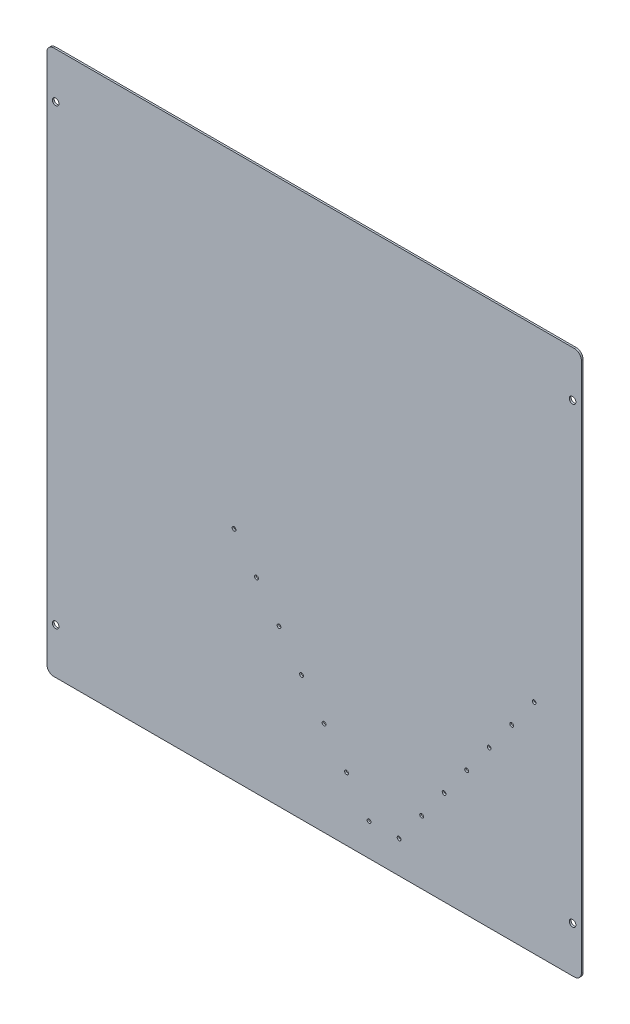
ISO-10303-21;
HEADER;
FILE_DESCRIPTION(('STEP AP214'),'2;1');
FILE_NAME('part.step','',(''),(''),'','','');
FILE_SCHEMA(('AUTOMOTIVE_DESIGN { 1 0 10303 214 1 1 1 1 }'));
ENDSEC;
DATA;
#1=APPLICATION_CONTEXT('core data for automotive mechanical design processes');
#2=APPLICATION_PROTOCOL_DEFINITION('international standard','automotive_design',2000,#1);
#3=PRODUCT_CONTEXT('',#1,'mechanical');
#4=PRODUCT('Part','Part','',(#3));
#5=PRODUCT_RELATED_PRODUCT_CATEGORY('part','',(#4));
#6=PRODUCT_DEFINITION_FORMATION('','',#4);
#7=PRODUCT_DEFINITION_CONTEXT('part definition',#1,'design');
#8=PRODUCT_DEFINITION('design','',#6,#7);
#9=PRODUCT_DEFINITION_SHAPE('','',#8);
#10=(LENGTH_UNIT() NAMED_UNIT(*) SI_UNIT(.MILLI.,.METRE.));
#11=(NAMED_UNIT(*) PLANE_ANGLE_UNIT() SI_UNIT($,.RADIAN.));
#12=(NAMED_UNIT(*) SI_UNIT($,.STERADIAN.) SOLID_ANGLE_UNIT());
#13=UNCERTAINTY_MEASURE_WITH_UNIT(LENGTH_MEASURE(1.E-05),#10,'distance_accuracy_value','');
#14=(GEOMETRIC_REPRESENTATION_CONTEXT(3) GLOBAL_UNCERTAINTY_ASSIGNED_CONTEXT((#13)) GLOBAL_UNIT_ASSIGNED_CONTEXT((#10,
#11,#12)) REPRESENTATION_CONTEXT('',''));
#15=CARTESIAN_POINT('',(0.,0.,0.));
#16=DIRECTION('',(0.,0.,1.));
#17=DIRECTION('',(1.,0.,0.));
#18=AXIS2_PLACEMENT_3D('',#15,#16,#17);
#19=CARTESIAN_POINT('',(6.35,6.35,-1.5875));
#20=DIRECTION('',(0.,0.,1.));
#21=DIRECTION('',(1.,0.,0.));
#22=AXIS2_PLACEMENT_3D('',#19,#20,#21);
#23=CYLINDRICAL_SURFACE('',#22,6.35);
#24=CARTESIAN_POINT('',(6.35,6.35,0.));
#25=DIRECTION('',(0.,0.,1.));
#26=DIRECTION('',(1.,0.,0.));
#27=AXIS2_PLACEMENT_3D('',#24,#25,#26);
#28=CIRCLE('',#27,6.35);
#29=CARTESIAN_POINT('',(0.,6.35000000000004,0.));
#30=VERTEX_POINT('',#29);
#31=CARTESIAN_POINT('',(6.35000000000004,0.,0.));
#32=VERTEX_POINT('',#31);
#33=EDGE_CURVE('E133',#30,#32,#28,.T.);
#34=ORIENTED_EDGE('',*,*,#33,.F.);
#35=DIRECTION('',(0.,0.,1.));
#36=VECTOR('',#35,1.);
#37=CARTESIAN_POINT('',(0.,6.35000000000004,-1.5875));
#38=LINE('',#37,#36);
#39=CARTESIAN_POINT('',(0.,6.35000000000004,-1.5875));
#40=VERTEX_POINT('',#39);
#41=EDGE_CURVE('E11',#40,#30,#38,.T.);
#42=ORIENTED_EDGE('',*,*,#41,.F.);
#43=CARTESIAN_POINT('',(6.35,6.35,-1.5875));
#44=DIRECTION('',(0.,0.,1.));
#45=DIRECTION('',(1.,0.,0.));
#46=AXIS2_PLACEMENT_3D('',#43,#44,#45);
#47=CIRCLE('',#46,6.35);
#48=CARTESIAN_POINT('',(6.35000000000004,0.,-1.5875));
#49=VERTEX_POINT('',#48);
#50=EDGE_CURVE('E154',#40,#49,#47,.T.);
#51=ORIENTED_EDGE('',*,*,#50,.T.);
#52=DIRECTION('',(0.,0.,1.));
#53=VECTOR('',#52,1.);
#54=CARTESIAN_POINT('',(6.35000000000004,0.,-1.5875));
#55=LINE('',#54,#53);
#56=EDGE_CURVE('E91',#49,#32,#55,.T.);
#57=ORIENTED_EDGE('',*,*,#56,.T.);
#58=EDGE_LOOP('',(#34,#42,#51,#57));
#59=FACE_BOUND('',#58,.T.);
#60=ADVANCED_FACE('F35',(#59),#23,.T.);
#61=CARTESIAN_POINT('',(0.,6.35000000000004,-1.5875));
#62=DIRECTION('',(-1.,0.,0.));
#63=DIRECTION('',(0.,-1.,0.));
#64=AXIS2_PLACEMENT_3D('',#61,#62,#63);
#65=PLANE('',#64);
#66=DIRECTION('',(0.,-1.,0.));
#67=VECTOR('',#66,1.);
#68=CARTESIAN_POINT('',(0.,6.35000000000004,0.));
#69=LINE('',#68,#67);
#70=CARTESIAN_POINT('',(-1.09587905789873E-13,485.14,0.));
#71=VERTEX_POINT('',#70);
#72=EDGE_CURVE('E152',#71,#30,#69,.T.);
#73=ORIENTED_EDGE('',*,*,#72,.F.);
#74=DIRECTION('',(0.,0.,1.));
#75=VECTOR('',#74,1.);
#76=CARTESIAN_POINT('',(-1.09587905789873E-13,485.14,-1.5875));
#77=LINE('',#76,#75);
#78=CARTESIAN_POINT('',(-1.09587905789873E-13,485.14,-1.5875));
#79=VERTEX_POINT('',#78);
#80=EDGE_CURVE('E44',#79,#71,#77,.T.);
#81=ORIENTED_EDGE('',*,*,#80,.F.);
#82=DIRECTION('',(0.,-1.,0.));
#83=VECTOR('',#82,1.);
#84=CARTESIAN_POINT('',(0.,6.35000000000004,-1.5875));
#85=LINE('',#84,#83);
#86=EDGE_CURVE('E123',#79,#40,#85,.T.);
#87=ORIENTED_EDGE('',*,*,#86,.T.);
#88=ORIENTED_EDGE('',*,*,#41,.T.);
#89=EDGE_LOOP('',(#73,#81,#87,#88));
#90=FACE_BOUND('',#89,.T.);
#91=ADVANCED_FACE('F226',(#90),#65,.T.);
#92=CARTESIAN_POINT('',(6.34999999999989,485.14,-1.5875));
#93=DIRECTION('',(0.,0.,1.));
#94=DIRECTION('',(1.,0.,0.));
#95=AXIS2_PLACEMENT_3D('',#92,#93,#94);
#96=CYLINDRICAL_SURFACE('',#95,6.35000000000001);
#97=CARTESIAN_POINT('',(6.34999999999989,485.14,0.));
#98=DIRECTION('',(0.,0.,1.));
#99=DIRECTION('',(-1.,0.,0.));
#100=AXIS2_PLACEMENT_3D('',#97,#98,#99);
#101=CIRCLE('',#100,6.35000000000001);
#102=CARTESIAN_POINT('',(6.34999999999993,491.49,0.));
#103=VERTEX_POINT('',#102);
#104=EDGE_CURVE('E110',#103,#71,#101,.T.);
#105=ORIENTED_EDGE('',*,*,#104,.F.);
#106=DIRECTION('',(0.,0.,1.));
#107=VECTOR('',#106,1.);
#108=CARTESIAN_POINT('',(6.34999999999993,491.49,-1.5875));
#109=LINE('',#108,#107);
#110=CARTESIAN_POINT('',(6.34999999999993,491.49,-1.5875));
#111=VERTEX_POINT('',#110);
#112=EDGE_CURVE('E105',#111,#103,#109,.T.);
#113=ORIENTED_EDGE('',*,*,#112,.F.);
#114=CARTESIAN_POINT('',(6.34999999999989,485.14,-1.5875));
#115=DIRECTION('',(0.,0.,1.));
#116=DIRECTION('',(-1.,0.,0.));
#117=AXIS2_PLACEMENT_3D('',#114,#115,#116);
#118=CIRCLE('',#117,6.35000000000001);
#119=EDGE_CURVE('E108',#111,#79,#118,.T.);
#120=ORIENTED_EDGE('',*,*,#119,.T.);
#121=ORIENTED_EDGE('',*,*,#80,.T.);
#122=EDGE_LOOP('',(#105,#113,#120,#121));
#123=FACE_BOUND('',#122,.T.);
#124=ADVANCED_FACE('F107',(#123),#96,.T.);
#125=CARTESIAN_POINT('',(6.34999999999993,491.49,-1.5875));
#126=DIRECTION('',(0.,1.,0.));
#127=DIRECTION('',(0.,0.,1.));
#128=AXIS2_PLACEMENT_3D('',#125,#126,#127);
#129=PLANE('',#128);
#130=DIRECTION('',(-1.,0.,0.));
#131=VECTOR('',#130,1.);
#132=CARTESIAN_POINT('',(6.34999999999993,491.49,0.));
#133=LINE('',#132,#131);
#134=CARTESIAN_POINT('',(476.25,491.49,0.));
#135=VERTEX_POINT('',#134);
#136=EDGE_CURVE('E149',#135,#103,#133,.T.);
#137=ORIENTED_EDGE('',*,*,#136,.F.);
#138=DIRECTION('',(0.,0.,1.));
#139=VECTOR('',#138,1.);
#140=CARTESIAN_POINT('',(476.25,491.49,-1.5875));
#141=LINE('',#140,#139);
#142=CARTESIAN_POINT('',(476.25,491.49,-1.5875));
#143=VERTEX_POINT('',#142);
#144=EDGE_CURVE('E115',#143,#135,#141,.T.);
#145=ORIENTED_EDGE('',*,*,#144,.F.);
#146=DIRECTION('',(-1.,0.,0.));
#147=VECTOR('',#146,1.);
#148=CARTESIAN_POINT('',(6.34999999999993,491.49,-1.5875));
#149=LINE('',#148,#147);
#150=EDGE_CURVE('E121',#143,#111,#149,.T.);
#151=ORIENTED_EDGE('',*,*,#150,.T.);
#152=ORIENTED_EDGE('',*,*,#112,.T.);
#153=EDGE_LOOP('',(#137,#145,#151,#152));
#154=FACE_BOUND('',#153,.T.);
#155=ADVANCED_FACE('F125',(#154),#129,.T.);
#156=CARTESIAN_POINT('',(476.25,485.14,-1.5875));
#157=DIRECTION('',(0.,0.,1.));
#158=DIRECTION('',(1.,0.,0.));
#159=AXIS2_PLACEMENT_3D('',#156,#157,#158);
#160=CYLINDRICAL_SURFACE('',#159,6.35000000000002);
#161=CARTESIAN_POINT('',(476.25,485.14,0.));
#162=DIRECTION('',(0.,0.,1.));
#163=DIRECTION('',(1.,0.,0.));
#164=AXIS2_PLACEMENT_3D('',#161,#162,#163);
#165=CIRCLE('',#164,6.35000000000002);
#166=CARTESIAN_POINT('',(482.6,485.14,0.));
#167=VERTEX_POINT('',#166);
#168=EDGE_CURVE('E146',#167,#135,#165,.T.);
#169=ORIENTED_EDGE('',*,*,#168,.F.);
#170=DIRECTION('',(0.,0.,1.));
#171=VECTOR('',#170,1.);
#172=CARTESIAN_POINT('',(482.6,485.14,-1.5875));
#173=LINE('',#172,#171);
#174=CARTESIAN_POINT('',(482.6,485.14,-1.5875));
#175=VERTEX_POINT('',#174);
#176=EDGE_CURVE('E158',#175,#167,#173,.T.);
#177=ORIENTED_EDGE('',*,*,#176,.F.);
#178=CARTESIAN_POINT('',(476.25,485.14,-1.5875));
#179=DIRECTION('',(0.,0.,1.));
#180=DIRECTION('',(1.,0.,0.));
#181=AXIS2_PLACEMENT_3D('',#178,#179,#180);
#182=CIRCLE('',#181,6.35000000000002);
#183=EDGE_CURVE('E126',#175,#143,#182,.T.);
#184=ORIENTED_EDGE('',*,*,#183,.T.);
#185=ORIENTED_EDGE('',*,*,#144,.T.);
#186=EDGE_LOOP('',(#169,#177,#184,#185));
#187=FACE_BOUND('',#186,.T.);
#188=ADVANCED_FACE('F239',(#187),#160,.T.);
#189=CARTESIAN_POINT('',(482.6,6.35000000000004,-1.5875));
#190=DIRECTION('',(1.,0.,0.));
#191=DIRECTION('',(0.,1.,0.));
#192=AXIS2_PLACEMENT_3D('',#189,#190,#191);
#193=PLANE('',#192);
#194=DIRECTION('',(0.,1.,0.));
#195=VECTOR('',#194,1.);
#196=CARTESIAN_POINT('',(482.6,6.35000000000004,0.));
#197=LINE('',#196,#195);
#198=CARTESIAN_POINT('',(482.6,6.35000000000004,0.));
#199=VERTEX_POINT('',#198);
#200=EDGE_CURVE('E143',#199,#167,#197,.T.);
#201=ORIENTED_EDGE('',*,*,#200,.F.);
#202=DIRECTION('',(0.,0.,1.));
#203=VECTOR('',#202,1.);
#204=CARTESIAN_POINT('',(482.6,6.35000000000004,-1.5875));
#205=LINE('',#204,#203);
#206=CARTESIAN_POINT('',(482.6,6.35000000000004,-1.5875));
#207=VERTEX_POINT('',#206);
#208=EDGE_CURVE('E160',#207,#199,#205,.T.);
#209=ORIENTED_EDGE('',*,*,#208,.F.);
#210=DIRECTION('',(0.,1.,0.));
#211=VECTOR('',#210,1.);
#212=CARTESIAN_POINT('',(482.6,6.35000000000004,-1.5875));
#213=LINE('',#212,#211);
#214=EDGE_CURVE('E128',#207,#175,#213,.T.);
#215=ORIENTED_EDGE('',*,*,#214,.T.);
#216=ORIENTED_EDGE('',*,*,#176,.T.);
#217=EDGE_LOOP('',(#201,#209,#215,#216));
#218=FACE_BOUND('',#217,.T.);
#219=ADVANCED_FACE('F217',(#218),#193,.T.);
#220=CARTESIAN_POINT('',(476.25,6.35,-1.5875));
#221=DIRECTION('',(0.,0.,1.));
#222=DIRECTION('',(1.,0.,0.));
#223=AXIS2_PLACEMENT_3D('',#220,#221,#222);
#224=CYLINDRICAL_SURFACE('',#223,6.35000000000001);
#225=CARTESIAN_POINT('',(476.25,6.35,0.));
#226=DIRECTION('',(0.,0.,1.));
#227=DIRECTION('',(1.,0.,0.));
#228=AXIS2_PLACEMENT_3D('',#225,#226,#227);
#229=CIRCLE('',#228,6.35000000000001);
#230=CARTESIAN_POINT('',(476.25,0.,0.));
#231=VERTEX_POINT('',#230);
#232=EDGE_CURVE('E140',#231,#199,#229,.T.);
#233=ORIENTED_EDGE('',*,*,#232,.F.);
#234=DIRECTION('',(0.,0.,1.));
#235=VECTOR('',#234,1.);
#236=CARTESIAN_POINT('',(476.25,0.,-1.5875));
#237=LINE('',#236,#235);
#238=CARTESIAN_POINT('',(476.25,0.,-1.5875));
#239=VERTEX_POINT('',#238);
#240=EDGE_CURVE('E162',#239,#231,#237,.T.);
#241=ORIENTED_EDGE('',*,*,#240,.F.);
#242=CARTESIAN_POINT('',(476.25,6.35,-1.5875));
#243=DIRECTION('',(0.,0.,1.));
#244=DIRECTION('',(1.,0.,0.));
#245=AXIS2_PLACEMENT_3D('',#242,#243,#244);
#246=CIRCLE('',#245,6.35000000000001);
#247=EDGE_CURVE('E211',#239,#207,#246,.T.);
#248=ORIENTED_EDGE('',*,*,#247,.T.);
#249=ORIENTED_EDGE('',*,*,#208,.T.);
#250=EDGE_LOOP('',(#233,#241,#248,#249));
#251=FACE_BOUND('',#250,.T.);
#252=ADVANCED_FACE('F222',(#251),#224,.T.);
#253=CARTESIAN_POINT('',(6.35000000000004,0.,-1.5875));
#254=DIRECTION('',(0.,-1.,0.));
#255=DIRECTION('',(0.,0.,-1.));
#256=AXIS2_PLACEMENT_3D('',#253,#254,#255);
#257=PLANE('',#256);
#258=DIRECTION('',(1.,0.,0.));
#259=VECTOR('',#258,1.);
#260=CARTESIAN_POINT('',(6.35000000000004,0.,0.));
#261=LINE('',#260,#259);
#262=EDGE_CURVE('E136',#32,#231,#261,.T.);
#263=ORIENTED_EDGE('',*,*,#262,.F.);
#264=ORIENTED_EDGE('',*,*,#56,.F.);
#265=DIRECTION('',(1.,0.,0.));
#266=VECTOR('',#265,1.);
#267=CARTESIAN_POINT('',(6.35000000000004,0.,-1.5875));
#268=LINE('',#267,#266);
#269=EDGE_CURVE('E209',#49,#239,#268,.T.);
#270=ORIENTED_EDGE('',*,*,#269,.T.);
#271=ORIENTED_EDGE('',*,*,#240,.T.);
#272=EDGE_LOOP('',(#263,#264,#270,#271));
#273=FACE_BOUND('',#272,.T.);
#274=ADVANCED_FACE('F223',(#273),#257,.T.);
#275=CARTESIAN_POINT('',(6.35,6.35,-1.5875));
#276=DIRECTION('',(0.,0.,1.));
#277=DIRECTION('',(1.,0.,0.));
#278=AXIS2_PLACEMENT_3D('',#275,#276,#277);
#279=PLANE('',#278);
#280=CARTESIAN_POINT('',(168.98874,196.850000000002,-1.5875));
#281=DIRECTION('',(0.,0.,1.));
#282=DIRECTION('',(1.,0.,0.));
#283=AXIS2_PLACEMENT_3D('',#280,#281,#282);
#284=CIRCLE('',#283,1.72719999999998);
#285=CARTESIAN_POINT('',(170.71594,196.850000000002,-1.5875));
#286=VERTEX_POINT('',#285);
#287=EDGE_CURVE('E38',#286,#286,#284,.T.);
#288=ORIENTED_EDGE('',*,*,#287,.T.);
#289=EDGE_LOOP('',(#288));
#290=FACE_BOUND('',#289,.T.);
#291=CARTESIAN_POINT('',(189.30874,168.910000000002,-1.5875));
#292=DIRECTION('',(0.,0.,1.));
#293=DIRECTION('',(1.,0.,0.));
#294=AXIS2_PLACEMENT_3D('',#291,#292,#293);
#295=CIRCLE('',#294,1.72719999999998);
#296=CARTESIAN_POINT('',(191.03594,168.910000000002,-1.5875));
#297=VERTEX_POINT('',#296);
#298=EDGE_CURVE('E337',#297,#297,#295,.T.);
#299=ORIENTED_EDGE('',*,*,#298,.T.);
#300=EDGE_LOOP('',(#299));
#301=FACE_BOUND('',#300,.T.);
#302=CARTESIAN_POINT('',(209.62874,140.970000000002,-1.5875));
#303=DIRECTION('',(0.,0.,1.));
#304=DIRECTION('',(1.,0.,0.));
#305=AXIS2_PLACEMENT_3D('',#302,#303,#304);
#306=CIRCLE('',#305,1.72719999999998);
#307=CARTESIAN_POINT('',(211.35594,140.970000000002,-1.5875));
#308=VERTEX_POINT('',#307);
#309=EDGE_CURVE('E346',#308,#308,#306,.T.);
#310=ORIENTED_EDGE('',*,*,#309,.T.);
#311=EDGE_LOOP('',(#310));
#312=FACE_BOUND('',#311,.T.);
#313=CARTESIAN_POINT('',(229.94874,113.030000000002,-1.5875));
#314=DIRECTION('',(0.,0.,1.));
#315=DIRECTION('',(1.,0.,0.));
#316=AXIS2_PLACEMENT_3D('',#313,#314,#315);
#317=CIRCLE('',#316,1.72719999999998);
#318=CARTESIAN_POINT('',(231.67594,113.030000000002,-1.5875));
#319=VERTEX_POINT('',#318);
#320=EDGE_CURVE('E352',#319,#319,#317,.T.);
#321=ORIENTED_EDGE('',*,*,#320,.T.);
#322=EDGE_LOOP('',(#321));
#323=FACE_BOUND('',#322,.T.);
#324=CARTESIAN_POINT('',(250.26874,85.0900000000021,-1.5875));
#325=DIRECTION('',(0.,0.,1.));
#326=DIRECTION('',(1.,0.,0.));
#327=AXIS2_PLACEMENT_3D('',#324,#325,#326);
#328=CIRCLE('',#327,1.72719999999998);
#329=CARTESIAN_POINT('',(251.99594,85.0900000000021,-1.5875));
#330=VERTEX_POINT('',#329);
#331=EDGE_CURVE('E358',#330,#330,#328,.T.);
#332=ORIENTED_EDGE('',*,*,#331,.T.);
#333=EDGE_LOOP('',(#332));
#334=FACE_BOUND('',#333,.T.);
#335=CARTESIAN_POINT('',(270.58874,57.150000000002,-1.5875));
#336=DIRECTION('',(0.,0.,1.));
#337=DIRECTION('',(1.,0.,0.));
#338=AXIS2_PLACEMENT_3D('',#335,#336,#337);
#339=CIRCLE('',#338,1.72719999999998);
#340=CARTESIAN_POINT('',(272.31594,57.150000000002,-1.5875));
#341=VERTEX_POINT('',#340);
#342=EDGE_CURVE('E364',#341,#341,#339,.T.);
#343=ORIENTED_EDGE('',*,*,#342,.T.);
#344=EDGE_LOOP('',(#343));
#345=FACE_BOUND('',#344,.T.);
#346=CARTESIAN_POINT('',(290.90874,29.210000000002,-1.5875));
#347=DIRECTION('',(0.,0.,1.));
#348=DIRECTION('',(1.,0.,0.));
#349=AXIS2_PLACEMENT_3D('',#346,#347,#348);
#350=CIRCLE('',#349,1.72719999999998);
#351=CARTESIAN_POINT('',(292.63594,29.210000000002,-1.5875));
#352=VERTEX_POINT('',#351);
#353=EDGE_CURVE('E370',#352,#352,#350,.T.);
#354=ORIENTED_EDGE('',*,*,#353,.T.);
#355=EDGE_LOOP('',(#354));
#356=FACE_BOUND('',#355,.T.);
#357=CARTESIAN_POINT('',(318.05499,29.210000000002,-1.5875));
#358=DIRECTION('',(0.,0.,1.));
#359=DIRECTION('',(1.,0.,0.));
#360=AXIS2_PLACEMENT_3D('',#357,#358,#359);
#361=CIRCLE('',#360,1.72719999999998);
#362=CARTESIAN_POINT('',(319.78219,29.210000000002,-1.5875));
#363=VERTEX_POINT('',#362);
#364=EDGE_CURVE('E376',#363,#363,#361,.T.);
#365=ORIENTED_EDGE('',*,*,#364,.T.);
#366=EDGE_LOOP('',(#365));
#367=FACE_BOUND('',#366,.T.);
#368=CARTESIAN_POINT('',(338.37499,57.1500000000025,-1.5875));
#369=DIRECTION('',(0.,0.,1.));
#370=DIRECTION('',(1.,0.,0.));
#371=AXIS2_PLACEMENT_3D('',#368,#369,#370);
#372=CIRCLE('',#371,1.72719999999998);
#373=CARTESIAN_POINT('',(340.10219,57.1500000000025,-1.5875));
#374=VERTEX_POINT('',#373);
#375=EDGE_CURVE('E382',#374,#374,#372,.T.);
#376=ORIENTED_EDGE('',*,*,#375,.T.);
#377=EDGE_LOOP('',(#376));
#378=FACE_BOUND('',#377,.T.);
#379=CARTESIAN_POINT('',(358.69499,85.0900000000025,-1.5875));
#380=DIRECTION('',(0.,0.,1.));
#381=DIRECTION('',(1.,0.,0.));
#382=AXIS2_PLACEMENT_3D('',#379,#380,#381);
#383=CIRCLE('',#382,1.72719999999998);
#384=CARTESIAN_POINT('',(360.42219,85.0900000000025,-1.5875));
#385=VERTEX_POINT('',#384);
#386=EDGE_CURVE('E388',#385,#385,#383,.T.);
#387=ORIENTED_EDGE('',*,*,#386,.T.);
#388=EDGE_LOOP('',(#387));
#389=FACE_BOUND('',#388,.T.);
#390=CARTESIAN_POINT('',(379.01499,113.030000000003,-1.5875));
#391=DIRECTION('',(0.,0.,1.));
#392=DIRECTION('',(1.,0.,0.));
#393=AXIS2_PLACEMENT_3D('',#390,#391,#392);
#394=CIRCLE('',#393,1.72719999999998);
#395=CARTESIAN_POINT('',(380.74219,113.030000000003,-1.5875));
#396=VERTEX_POINT('',#395);
#397=EDGE_CURVE('E394',#396,#396,#394,.T.);
#398=ORIENTED_EDGE('',*,*,#397,.T.);
#399=EDGE_LOOP('',(#398));
#400=FACE_BOUND('',#399,.T.);
#401=CARTESIAN_POINT('',(439.97499,196.850000000002,-1.5875));
#402=DIRECTION('',(0.,0.,1.));
#403=DIRECTION('',(1.,0.,0.));
#404=AXIS2_PLACEMENT_3D('',#401,#402,#403);
#405=CIRCLE('',#404,1.72719999999998);
#406=CARTESIAN_POINT('',(441.70219,196.850000000002,-1.5875));
#407=VERTEX_POINT('',#406);
#408=EDGE_CURVE('E177',#407,#407,#405,.T.);
#409=ORIENTED_EDGE('',*,*,#408,.T.);
#410=EDGE_LOOP('',(#409));
#411=FACE_BOUND('',#410,.T.);
#412=CARTESIAN_POINT('',(419.65499,168.910000000003,-1.5875));
#413=DIRECTION('',(0.,0.,1.));
#414=DIRECTION('',(1.,0.,0.));
#415=AXIS2_PLACEMENT_3D('',#412,#413,#414);
#416=CIRCLE('',#415,1.72719999999998);
#417=CARTESIAN_POINT('',(421.38219,168.910000000003,-1.5875));
#418=VERTEX_POINT('',#417);
#419=EDGE_CURVE('E169',#418,#418,#416,.T.);
#420=ORIENTED_EDGE('',*,*,#419,.T.);
#421=EDGE_LOOP('',(#420));
#422=FACE_BOUND('',#421,.T.);
#423=CARTESIAN_POINT('',(399.33499,140.970000000003,-1.5875));
#424=DIRECTION('',(0.,0.,1.));
#425=DIRECTION('',(1.,0.,0.));
#426=AXIS2_PLACEMENT_3D('',#423,#424,#425);
#427=CIRCLE('',#426,1.72719999999998);
#428=CARTESIAN_POINT('',(401.06219,140.970000000003,-1.5875));
#429=VERTEX_POINT('',#428);
#430=EDGE_CURVE('E165',#429,#429,#427,.T.);
#431=ORIENTED_EDGE('',*,*,#430,.T.);
#432=EDGE_LOOP('',(#431));
#433=FACE_BOUND('',#432,.T.);
#434=CARTESIAN_POINT('',(474.662495063371,41.2744703489729,-1.5875));
#435=DIRECTION('',(0.,0.,1.));
#436=DIRECTION('',(1.,0.,0.));
#437=AXIS2_PLACEMENT_3D('',#434,#435,#436);
#438=CIRCLE('',#437,2.97180000000002);
#439=CARTESIAN_POINT('',(477.634295063371,41.2744703489729,-1.5875));
#440=VERTEX_POINT('',#439);
#441=EDGE_CURVE('E188',#440,#440,#438,.T.);
#442=ORIENTED_EDGE('',*,*,#441,.T.);
#443=EDGE_LOOP('',(#442));
#444=FACE_BOUND('',#443,.T.);
#445=CARTESIAN_POINT('',(474.6625,450.214409774319,-1.5875));
#446=DIRECTION('',(0.,0.,1.));
#447=DIRECTION('',(1.,0.,0.));
#448=AXIS2_PLACEMENT_3D('',#445,#446,#447);
#449=CIRCLE('',#448,2.97180000000002);
#450=CARTESIAN_POINT('',(477.6343,450.214409774319,-1.5875));
#451=VERTEX_POINT('',#450);
#452=EDGE_CURVE('E194',#451,#451,#449,.T.);
#453=ORIENTED_EDGE('',*,*,#452,.T.);
#454=EDGE_LOOP('',(#453));
#455=FACE_BOUND('',#454,.T.);
#456=CARTESIAN_POINT('',(7.93750000000026,450.215,-1.5875));
#457=DIRECTION('',(0.,0.,1.));
#458=DIRECTION('',(1.,0.,0.));
#459=AXIS2_PLACEMENT_3D('',#456,#457,#458);
#460=CIRCLE('',#459,2.9718);
#461=CARTESIAN_POINT('',(10.9093000000003,450.215,-1.5875));
#462=VERTEX_POINT('',#461);
#463=EDGE_CURVE('E200',#462,#462,#460,.T.);
#464=ORIENTED_EDGE('',*,*,#463,.T.);
#465=EDGE_LOOP('',(#464));
#466=FACE_BOUND('',#465,.T.);
#467=CARTESIAN_POINT('',(7.93749506337066,41.2744703489727,-1.5875));
#468=DIRECTION('',(0.,0.,1.));
#469=DIRECTION('',(1.,0.,0.));
#470=AXIS2_PLACEMENT_3D('',#467,#468,#469);
#471=CIRCLE('',#470,2.9718);
#472=CARTESIAN_POINT('',(10.9092950633707,41.2744703489727,-1.5875));
#473=VERTEX_POINT('',#472);
#474=EDGE_CURVE('E137',#473,#473,#471,.T.);
#475=ORIENTED_EDGE('',*,*,#474,.T.);
#476=EDGE_LOOP('',(#475));
#477=FACE_BOUND('',#476,.T.);
#478=ORIENTED_EDGE('',*,*,#50,.F.);
#479=ORIENTED_EDGE('',*,*,#86,.F.);
#480=ORIENTED_EDGE('',*,*,#119,.F.);
#481=ORIENTED_EDGE('',*,*,#150,.F.);
#482=ORIENTED_EDGE('',*,*,#183,.F.);
#483=ORIENTED_EDGE('',*,*,#214,.F.);
#484=ORIENTED_EDGE('',*,*,#247,.F.);
#485=ORIENTED_EDGE('',*,*,#269,.F.);
#486=EDGE_LOOP('',(#478,#479,#480,#481,#482,#483,#484,#485));
#487=FACE_BOUND('',#486,.T.);
#488=ADVANCED_FACE('F119',(#290,#301,#312,#323,#334,#345,#356,#367,#378,#389,#400,#411,#422,
#433,#444,#455,#466,#477,#487),#279,.F.);
#489=CARTESIAN_POINT('',(6.35,6.35,0.));
#490=DIRECTION('',(0.,0.,1.));
#491=DIRECTION('',(1.,0.,0.));
#492=AXIS2_PLACEMENT_3D('',#489,#490,#491);
#493=PLANE('',#492);
#494=CARTESIAN_POINT('',(168.98874,196.850000000002,0.));
#495=DIRECTION('',(0.,0.,1.));
#496=DIRECTION('',(1.,0.,0.));
#497=AXIS2_PLACEMENT_3D('',#494,#495,#496);
#498=CIRCLE('',#497,1.72719999999998);
#499=CARTESIAN_POINT('',(170.71594,196.850000000002,0.));
#500=VERTEX_POINT('',#499);
#501=EDGE_CURVE('E333',#500,#500,#498,.T.);
#502=ORIENTED_EDGE('',*,*,#501,.F.);
#503=EDGE_LOOP('',(#502));
#504=FACE_BOUND('',#503,.T.);
#505=CARTESIAN_POINT('',(189.30874,168.910000000002,0.));
#506=DIRECTION('',(0.,0.,1.));
#507=DIRECTION('',(1.,0.,0.));
#508=AXIS2_PLACEMENT_3D('',#505,#506,#507);
#509=CIRCLE('',#508,1.72719999999998);
#510=CARTESIAN_POINT('',(191.03594,168.910000000002,0.));
#511=VERTEX_POINT('',#510);
#512=EDGE_CURVE('E335',#511,#511,#509,.T.);
#513=ORIENTED_EDGE('',*,*,#512,.F.);
#514=EDGE_LOOP('',(#513));
#515=FACE_BOUND('',#514,.T.);
#516=CARTESIAN_POINT('',(209.62874,140.970000000002,0.));
#517=DIRECTION('',(0.,0.,1.));
#518=DIRECTION('',(1.,0.,0.));
#519=AXIS2_PLACEMENT_3D('',#516,#517,#518);
#520=CIRCLE('',#519,1.72719999999998);
#521=CARTESIAN_POINT('',(211.35594,140.970000000002,0.));
#522=VERTEX_POINT('',#521);
#523=EDGE_CURVE('E343',#522,#522,#520,.T.);
#524=ORIENTED_EDGE('',*,*,#523,.F.);
#525=EDGE_LOOP('',(#524));
#526=FACE_BOUND('',#525,.T.);
#527=CARTESIAN_POINT('',(229.94874,113.030000000002,0.));
#528=DIRECTION('',(0.,0.,1.));
#529=DIRECTION('',(1.,0.,0.));
#530=AXIS2_PLACEMENT_3D('',#527,#528,#529);
#531=CIRCLE('',#530,1.72719999999998);
#532=CARTESIAN_POINT('',(231.67594,113.030000000002,0.));
#533=VERTEX_POINT('',#532);
#534=EDGE_CURVE('E349',#533,#533,#531,.T.);
#535=ORIENTED_EDGE('',*,*,#534,.F.);
#536=EDGE_LOOP('',(#535));
#537=FACE_BOUND('',#536,.T.);
#538=CARTESIAN_POINT('',(250.26874,85.0900000000021,0.));
#539=DIRECTION('',(0.,0.,1.));
#540=DIRECTION('',(1.,0.,0.));
#541=AXIS2_PLACEMENT_3D('',#538,#539,#540);
#542=CIRCLE('',#541,1.72719999999998);
#543=CARTESIAN_POINT('',(251.99594,85.0900000000021,0.));
#544=VERTEX_POINT('',#543);
#545=EDGE_CURVE('E355',#544,#544,#542,.T.);
#546=ORIENTED_EDGE('',*,*,#545,.F.);
#547=EDGE_LOOP('',(#546));
#548=FACE_BOUND('',#547,.T.);
#549=CARTESIAN_POINT('',(270.58874,57.150000000002,0.));
#550=DIRECTION('',(0.,0.,1.));
#551=DIRECTION('',(1.,0.,0.));
#552=AXIS2_PLACEMENT_3D('',#549,#550,#551);
#553=CIRCLE('',#552,1.72719999999998);
#554=CARTESIAN_POINT('',(272.31594,57.150000000002,0.));
#555=VERTEX_POINT('',#554);
#556=EDGE_CURVE('E361',#555,#555,#553,.T.);
#557=ORIENTED_EDGE('',*,*,#556,.F.);
#558=EDGE_LOOP('',(#557));
#559=FACE_BOUND('',#558,.T.);
#560=CARTESIAN_POINT('',(290.90874,29.210000000002,0.));
#561=DIRECTION('',(0.,0.,1.));
#562=DIRECTION('',(1.,0.,0.));
#563=AXIS2_PLACEMENT_3D('',#560,#561,#562);
#564=CIRCLE('',#563,1.72719999999998);
#565=CARTESIAN_POINT('',(292.63594,29.210000000002,0.));
#566=VERTEX_POINT('',#565);
#567=EDGE_CURVE('E367',#566,#566,#564,.T.);
#568=ORIENTED_EDGE('',*,*,#567,.F.);
#569=EDGE_LOOP('',(#568));
#570=FACE_BOUND('',#569,.T.);
#571=CARTESIAN_POINT('',(318.05499,29.210000000002,0.));
#572=DIRECTION('',(0.,0.,1.));
#573=DIRECTION('',(1.,0.,0.));
#574=AXIS2_PLACEMENT_3D('',#571,#572,#573);
#575=CIRCLE('',#574,1.72719999999998);
#576=CARTESIAN_POINT('',(319.78219,29.210000000002,0.));
#577=VERTEX_POINT('',#576);
#578=EDGE_CURVE('E373',#577,#577,#575,.T.);
#579=ORIENTED_EDGE('',*,*,#578,.F.);
#580=EDGE_LOOP('',(#579));
#581=FACE_BOUND('',#580,.T.);
#582=CARTESIAN_POINT('',(338.37499,57.1500000000025,0.));
#583=DIRECTION('',(0.,0.,1.));
#584=DIRECTION('',(1.,0.,0.));
#585=AXIS2_PLACEMENT_3D('',#582,#583,#584);
#586=CIRCLE('',#585,1.72719999999998);
#587=CARTESIAN_POINT('',(340.10219,57.1500000000025,0.));
#588=VERTEX_POINT('',#587);
#589=EDGE_CURVE('E379',#588,#588,#586,.T.);
#590=ORIENTED_EDGE('',*,*,#589,.F.);
#591=EDGE_LOOP('',(#590));
#592=FACE_BOUND('',#591,.T.);
#593=CARTESIAN_POINT('',(358.69499,85.0900000000025,0.));
#594=DIRECTION('',(0.,0.,1.));
#595=DIRECTION('',(1.,0.,0.));
#596=AXIS2_PLACEMENT_3D('',#593,#594,#595);
#597=CIRCLE('',#596,1.72719999999998);
#598=CARTESIAN_POINT('',(360.42219,85.0900000000025,0.));
#599=VERTEX_POINT('',#598);
#600=EDGE_CURVE('E385',#599,#599,#597,.T.);
#601=ORIENTED_EDGE('',*,*,#600,.F.);
#602=EDGE_LOOP('',(#601));
#603=FACE_BOUND('',#602,.T.);
#604=CARTESIAN_POINT('',(379.01499,113.030000000003,0.));
#605=DIRECTION('',(0.,0.,1.));
#606=DIRECTION('',(1.,0.,0.));
#607=AXIS2_PLACEMENT_3D('',#604,#605,#606);
#608=CIRCLE('',#607,1.72719999999998);
#609=CARTESIAN_POINT('',(380.74219,113.030000000003,0.));
#610=VERTEX_POINT('',#609);
#611=EDGE_CURVE('E391',#610,#610,#608,.T.);
#612=ORIENTED_EDGE('',*,*,#611,.F.);
#613=EDGE_LOOP('',(#612));
#614=FACE_BOUND('',#613,.T.);
#615=CARTESIAN_POINT('',(439.97499,196.850000000002,0.));
#616=DIRECTION('',(0.,0.,1.));
#617=DIRECTION('',(1.,0.,0.));
#618=AXIS2_PLACEMENT_3D('',#615,#616,#617);
#619=CIRCLE('',#618,1.72719999999998);
#620=CARTESIAN_POINT('',(441.70219,196.850000000002,0.));
#621=VERTEX_POINT('',#620);
#622=EDGE_CURVE('E182',#621,#621,#619,.T.);
#623=ORIENTED_EDGE('',*,*,#622,.F.);
#624=EDGE_LOOP('',(#623));
#625=FACE_BOUND('',#624,.T.);
#626=CARTESIAN_POINT('',(419.65499,168.910000000003,0.));
#627=DIRECTION('',(0.,0.,1.));
#628=DIRECTION('',(1.,0.,0.));
#629=AXIS2_PLACEMENT_3D('',#626,#627,#628);
#630=CIRCLE('',#629,1.72719999999998);
#631=CARTESIAN_POINT('',(421.38219,168.910000000003,0.));
#632=VERTEX_POINT('',#631);
#633=EDGE_CURVE('E171',#632,#632,#630,.T.);
#634=ORIENTED_EDGE('',*,*,#633,.F.);
#635=EDGE_LOOP('',(#634));
#636=FACE_BOUND('',#635,.T.);
#637=CARTESIAN_POINT('',(399.33499,140.970000000003,0.));
#638=DIRECTION('',(0.,0.,1.));
#639=DIRECTION('',(1.,0.,0.));
#640=AXIS2_PLACEMENT_3D('',#637,#638,#639);
#641=CIRCLE('',#640,1.72719999999998);
#642=CARTESIAN_POINT('',(401.06219,140.970000000003,0.));
#643=VERTEX_POINT('',#642);
#644=EDGE_CURVE('E168',#643,#643,#641,.T.);
#645=ORIENTED_EDGE('',*,*,#644,.F.);
#646=EDGE_LOOP('',(#645));
#647=FACE_BOUND('',#646,.T.);
#648=CARTESIAN_POINT('',(474.662495063371,41.2744703489729,0.));
#649=DIRECTION('',(0.,0.,1.));
#650=DIRECTION('',(1.,0.,0.));
#651=AXIS2_PLACEMENT_3D('',#648,#649,#650);
#652=CIRCLE('',#651,2.97180000000002);
#653=CARTESIAN_POINT('',(477.634295063371,41.2744703489729,0.));
#654=VERTEX_POINT('',#653);
#655=EDGE_CURVE('E167',#654,#654,#652,.T.);
#656=ORIENTED_EDGE('',*,*,#655,.F.);
#657=EDGE_LOOP('',(#656));
#658=FACE_BOUND('',#657,.T.);
#659=CARTESIAN_POINT('',(474.6625,450.214409774319,0.));
#660=DIRECTION('',(0.,0.,1.));
#661=DIRECTION('',(1.,0.,0.));
#662=AXIS2_PLACEMENT_3D('',#659,#660,#661);
#663=CIRCLE('',#662,2.97180000000002);
#664=CARTESIAN_POINT('',(477.6343,450.214409774319,0.));
#665=VERTEX_POINT('',#664);
#666=EDGE_CURVE('E191',#665,#665,#663,.T.);
#667=ORIENTED_EDGE('',*,*,#666,.F.);
#668=EDGE_LOOP('',(#667));
#669=FACE_BOUND('',#668,.T.);
#670=CARTESIAN_POINT('',(7.93750000000026,450.215,0.));
#671=DIRECTION('',(0.,0.,1.));
#672=DIRECTION('',(1.,0.,0.));
#673=AXIS2_PLACEMENT_3D('',#670,#671,#672);
#674=CIRCLE('',#673,2.9718);
#675=CARTESIAN_POINT('',(10.9093000000003,450.215,0.));
#676=VERTEX_POINT('',#675);
#677=EDGE_CURVE('E197',#676,#676,#674,.T.);
#678=ORIENTED_EDGE('',*,*,#677,.F.);
#679=EDGE_LOOP('',(#678));
#680=FACE_BOUND('',#679,.T.);
#681=CARTESIAN_POINT('',(7.93749506337066,41.2744703489727,0.));
#682=DIRECTION('',(0.,0.,1.));
#683=DIRECTION('',(1.,0.,0.));
#684=AXIS2_PLACEMENT_3D('',#681,#682,#683);
#685=CIRCLE('',#684,2.9718);
#686=CARTESIAN_POINT('',(10.9092950633707,41.2744703489727,0.));
#687=VERTEX_POINT('',#686);
#688=EDGE_CURVE('E203',#687,#687,#685,.T.);
#689=ORIENTED_EDGE('',*,*,#688,.F.);
#690=EDGE_LOOP('',(#689));
#691=FACE_BOUND('',#690,.T.);
#692=ORIENTED_EDGE('',*,*,#33,.T.);
#693=ORIENTED_EDGE('',*,*,#262,.T.);
#694=ORIENTED_EDGE('',*,*,#232,.T.);
#695=ORIENTED_EDGE('',*,*,#200,.T.);
#696=ORIENTED_EDGE('',*,*,#168,.T.);
#697=ORIENTED_EDGE('',*,*,#136,.T.);
#698=ORIENTED_EDGE('',*,*,#104,.T.);
#699=ORIENTED_EDGE('',*,*,#72,.T.);
#700=EDGE_LOOP('',(#692,#693,#694,#695,#696,#697,#698,#699));
#701=FACE_BOUND('',#700,.T.);
#702=ADVANCED_FACE('F225',(#504,#515,#526,#537,#548,#559,#570,#581,#592,#603,#614,#625,#636,
#647,#658,#669,#680,#691,#701),#493,.T.);
#703=CARTESIAN_POINT('',(7.93749506337066,41.2744703489727,0.));
#704=DIRECTION('',(0.,0.,1.));
#705=DIRECTION('',(1.,0.,0.));
#706=AXIS2_PLACEMENT_3D('',#703,#704,#705);
#707=CYLINDRICAL_SURFACE('',#706,2.9718);
#708=ORIENTED_EDGE('',*,*,#688,.T.);
#709=EDGE_LOOP('',(#708));
#710=FACE_BOUND('',#709,.T.);
#711=ORIENTED_EDGE('',*,*,#474,.F.);
#712=EDGE_LOOP('',(#711));
#713=FACE_BOUND('',#712,.T.);
#714=ADVANCED_FACE('F254',(#710,#713),#707,.F.);
#715=CARTESIAN_POINT('',(7.93750000000026,450.215,0.));
#716=DIRECTION('',(0.,0.,1.));
#717=DIRECTION('',(1.,0.,0.));
#718=AXIS2_PLACEMENT_3D('',#715,#716,#717);
#719=CYLINDRICAL_SURFACE('',#718,2.9718);
#720=ORIENTED_EDGE('',*,*,#677,.T.);
#721=EDGE_LOOP('',(#720));
#722=FACE_BOUND('',#721,.T.);
#723=ORIENTED_EDGE('',*,*,#463,.F.);
#724=EDGE_LOOP('',(#723));
#725=FACE_BOUND('',#724,.T.);
#726=ADVANCED_FACE('F261',(#722,#725),#719,.F.);
#727=CARTESIAN_POINT('',(474.6625,450.214409774319,0.));
#728=DIRECTION('',(0.,0.,1.));
#729=DIRECTION('',(1.,0.,0.));
#730=AXIS2_PLACEMENT_3D('',#727,#728,#729);
#731=CYLINDRICAL_SURFACE('',#730,2.97180000000002);
#732=ORIENTED_EDGE('',*,*,#666,.T.);
#733=EDGE_LOOP('',(#732));
#734=FACE_BOUND('',#733,.T.);
#735=ORIENTED_EDGE('',*,*,#452,.F.);
#736=EDGE_LOOP('',(#735));
#737=FACE_BOUND('',#736,.T.);
#738=ADVANCED_FACE('F265',(#734,#737),#731,.F.);
#739=CARTESIAN_POINT('',(474.662495063371,41.2744703489729,0.));
#740=DIRECTION('',(0.,0.,1.));
#741=DIRECTION('',(1.,0.,0.));
#742=AXIS2_PLACEMENT_3D('',#739,#740,#741);
#743=CYLINDRICAL_SURFACE('',#742,2.97180000000002);
#744=ORIENTED_EDGE('',*,*,#655,.T.);
#745=EDGE_LOOP('',(#744));
#746=FACE_BOUND('',#745,.T.);
#747=ORIENTED_EDGE('',*,*,#441,.F.);
#748=EDGE_LOOP('',(#747));
#749=FACE_BOUND('',#748,.T.);
#750=ADVANCED_FACE('F269',(#746,#749),#743,.F.);
#751=CARTESIAN_POINT('',(399.33499,140.970000000003,0.));
#752=DIRECTION('',(0.,0.,1.));
#753=DIRECTION('',(1.,0.,0.));
#754=AXIS2_PLACEMENT_3D('',#751,#752,#753);
#755=CYLINDRICAL_SURFACE('',#754,1.72719999999998);
#756=ORIENTED_EDGE('',*,*,#644,.T.);
#757=EDGE_LOOP('',(#756));
#758=FACE_BOUND('',#757,.T.);
#759=ORIENTED_EDGE('',*,*,#430,.F.);
#760=EDGE_LOOP('',(#759));
#761=FACE_BOUND('',#760,.T.);
#762=ADVANCED_FACE('F273',(#758,#761),#755,.F.);
#763=CARTESIAN_POINT('',(419.65499,168.910000000003,0.));
#764=DIRECTION('',(0.,0.,1.));
#765=DIRECTION('',(1.,0.,0.));
#766=AXIS2_PLACEMENT_3D('',#763,#764,#765);
#767=CYLINDRICAL_SURFACE('',#766,1.72719999999998);
#768=ORIENTED_EDGE('',*,*,#633,.T.);
#769=EDGE_LOOP('',(#768));
#770=FACE_BOUND('',#769,.T.);
#771=ORIENTED_EDGE('',*,*,#419,.F.);
#772=EDGE_LOOP('',(#771));
#773=FACE_BOUND('',#772,.T.);
#774=ADVANCED_FACE('F277',(#770,#773),#767,.F.);
#775=CARTESIAN_POINT('',(439.97499,196.850000000002,0.));
#776=DIRECTION('',(0.,0.,1.));
#777=DIRECTION('',(1.,0.,0.));
#778=AXIS2_PLACEMENT_3D('',#775,#776,#777);
#779=CYLINDRICAL_SURFACE('',#778,1.72719999999998);
#780=ORIENTED_EDGE('',*,*,#622,.T.);
#781=EDGE_LOOP('',(#780));
#782=FACE_BOUND('',#781,.T.);
#783=ORIENTED_EDGE('',*,*,#408,.F.);
#784=EDGE_LOOP('',(#783));
#785=FACE_BOUND('',#784,.T.);
#786=ADVANCED_FACE('F281',(#782,#785),#779,.F.);
#787=CARTESIAN_POINT('',(379.01499,113.030000000003,0.));
#788=DIRECTION('',(0.,0.,1.));
#789=DIRECTION('',(1.,0.,0.));
#790=AXIS2_PLACEMENT_3D('',#787,#788,#789);
#791=CYLINDRICAL_SURFACE('',#790,1.72719999999998);
#792=ORIENTED_EDGE('',*,*,#611,.T.);
#793=EDGE_LOOP('',(#792));
#794=FACE_BOUND('',#793,.T.);
#795=ORIENTED_EDGE('',*,*,#397,.F.);
#796=EDGE_LOOP('',(#795));
#797=FACE_BOUND('',#796,.T.);
#798=ADVANCED_FACE('F284',(#794,#797),#791,.F.);
#799=CARTESIAN_POINT('',(358.69499,85.0900000000025,0.));
#800=DIRECTION('',(0.,0.,1.));
#801=DIRECTION('',(1.,0.,0.));
#802=AXIS2_PLACEMENT_3D('',#799,#800,#801);
#803=CYLINDRICAL_SURFACE('',#802,1.72719999999998);
#804=ORIENTED_EDGE('',*,*,#600,.T.);
#805=EDGE_LOOP('',(#804));
#806=FACE_BOUND('',#805,.T.);
#807=ORIENTED_EDGE('',*,*,#386,.F.);
#808=EDGE_LOOP('',(#807));
#809=FACE_BOUND('',#808,.T.);
#810=ADVANCED_FACE('F288',(#806,#809),#803,.F.);
#811=CARTESIAN_POINT('',(338.37499,57.1500000000025,0.));
#812=DIRECTION('',(0.,0.,1.));
#813=DIRECTION('',(1.,0.,0.));
#814=AXIS2_PLACEMENT_3D('',#811,#812,#813);
#815=CYLINDRICAL_SURFACE('',#814,1.72719999999998);
#816=ORIENTED_EDGE('',*,*,#589,.T.);
#817=EDGE_LOOP('',(#816));
#818=FACE_BOUND('',#817,.T.);
#819=ORIENTED_EDGE('',*,*,#375,.F.);
#820=EDGE_LOOP('',(#819));
#821=FACE_BOUND('',#820,.T.);
#822=ADVANCED_FACE('F292',(#818,#821),#815,.F.);
#823=CARTESIAN_POINT('',(318.05499,29.210000000002,0.));
#824=DIRECTION('',(0.,0.,1.));
#825=DIRECTION('',(1.,0.,0.));
#826=AXIS2_PLACEMENT_3D('',#823,#824,#825);
#827=CYLINDRICAL_SURFACE('',#826,1.72719999999998);
#828=ORIENTED_EDGE('',*,*,#578,.T.);
#829=EDGE_LOOP('',(#828));
#830=FACE_BOUND('',#829,.T.);
#831=ORIENTED_EDGE('',*,*,#364,.F.);
#832=EDGE_LOOP('',(#831));
#833=FACE_BOUND('',#832,.T.);
#834=ADVANCED_FACE('F296',(#830,#833),#827,.F.);
#835=CARTESIAN_POINT('',(290.90874,29.210000000002,0.));
#836=DIRECTION('',(0.,0.,1.));
#837=DIRECTION('',(1.,0.,0.));
#838=AXIS2_PLACEMENT_3D('',#835,#836,#837);
#839=CYLINDRICAL_SURFACE('',#838,1.72719999999998);
#840=ORIENTED_EDGE('',*,*,#567,.T.);
#841=EDGE_LOOP('',(#840));
#842=FACE_BOUND('',#841,.T.);
#843=ORIENTED_EDGE('',*,*,#353,.F.);
#844=EDGE_LOOP('',(#843));
#845=FACE_BOUND('',#844,.T.);
#846=ADVANCED_FACE('F300',(#842,#845),#839,.F.);
#847=CARTESIAN_POINT('',(270.58874,57.150000000002,0.));
#848=DIRECTION('',(0.,0.,1.));
#849=DIRECTION('',(1.,0.,0.));
#850=AXIS2_PLACEMENT_3D('',#847,#848,#849);
#851=CYLINDRICAL_SURFACE('',#850,1.72719999999998);
#852=ORIENTED_EDGE('',*,*,#556,.T.);
#853=EDGE_LOOP('',(#852));
#854=FACE_BOUND('',#853,.T.);
#855=ORIENTED_EDGE('',*,*,#342,.F.);
#856=EDGE_LOOP('',(#855));
#857=FACE_BOUND('',#856,.T.);
#858=ADVANCED_FACE('F304',(#854,#857),#851,.F.);
#859=CARTESIAN_POINT('',(250.26874,85.0900000000021,0.));
#860=DIRECTION('',(0.,0.,1.));
#861=DIRECTION('',(1.,0.,0.));
#862=AXIS2_PLACEMENT_3D('',#859,#860,#861);
#863=CYLINDRICAL_SURFACE('',#862,1.72719999999998);
#864=ORIENTED_EDGE('',*,*,#545,.T.);
#865=EDGE_LOOP('',(#864));
#866=FACE_BOUND('',#865,.T.);
#867=ORIENTED_EDGE('',*,*,#331,.F.);
#868=EDGE_LOOP('',(#867));
#869=FACE_BOUND('',#868,.T.);
#870=ADVANCED_FACE('F308',(#866,#869),#863,.F.);
#871=CARTESIAN_POINT('',(229.94874,113.030000000002,0.));
#872=DIRECTION('',(0.,0.,1.));
#873=DIRECTION('',(1.,0.,0.));
#874=AXIS2_PLACEMENT_3D('',#871,#872,#873);
#875=CYLINDRICAL_SURFACE('',#874,1.72719999999998);
#876=ORIENTED_EDGE('',*,*,#534,.T.);
#877=EDGE_LOOP('',(#876));
#878=FACE_BOUND('',#877,.T.);
#879=ORIENTED_EDGE('',*,*,#320,.F.);
#880=EDGE_LOOP('',(#879));
#881=FACE_BOUND('',#880,.T.);
#882=ADVANCED_FACE('F312',(#878,#881),#875,.F.);
#883=CARTESIAN_POINT('',(209.62874,140.970000000002,0.));
#884=DIRECTION('',(0.,0.,1.));
#885=DIRECTION('',(1.,0.,0.));
#886=AXIS2_PLACEMENT_3D('',#883,#884,#885);
#887=CYLINDRICAL_SURFACE('',#886,1.72719999999998);
#888=ORIENTED_EDGE('',*,*,#523,.T.);
#889=EDGE_LOOP('',(#888));
#890=FACE_BOUND('',#889,.T.);
#891=ORIENTED_EDGE('',*,*,#309,.F.);
#892=EDGE_LOOP('',(#891));
#893=FACE_BOUND('',#892,.T.);
#894=ADVANCED_FACE('F316',(#890,#893),#887,.F.);
#895=CARTESIAN_POINT('',(189.30874,168.910000000002,0.));
#896=DIRECTION('',(0.,0.,1.));
#897=DIRECTION('',(1.,0.,0.));
#898=AXIS2_PLACEMENT_3D('',#895,#896,#897);
#899=CYLINDRICAL_SURFACE('',#898,1.72719999999998);
#900=ORIENTED_EDGE('',*,*,#512,.T.);
#901=EDGE_LOOP('',(#900));
#902=FACE_BOUND('',#901,.T.);
#903=ORIENTED_EDGE('',*,*,#298,.F.);
#904=EDGE_LOOP('',(#903));
#905=FACE_BOUND('',#904,.T.);
#906=ADVANCED_FACE('F320',(#902,#905),#899,.F.);
#907=CARTESIAN_POINT('',(168.98874,196.850000000002,0.));
#908=DIRECTION('',(0.,0.,1.));
#909=DIRECTION('',(1.,0.,0.));
#910=AXIS2_PLACEMENT_3D('',#907,#908,#909);
#911=CYLINDRICAL_SURFACE('',#910,1.72719999999998);
#912=ORIENTED_EDGE('',*,*,#501,.T.);
#913=EDGE_LOOP('',(#912));
#914=FACE_BOUND('',#913,.T.);
#915=ORIENTED_EDGE('',*,*,#287,.F.);
#916=EDGE_LOOP('',(#915));
#917=FACE_BOUND('',#916,.T.);
#918=ADVANCED_FACE('F324',(#914,#917),#911,.F.);
#919=CLOSED_SHELL('',(#60,#91,#124,#155,#188,#219,#252,#274,#488,#702,#714,#726,#738,#750,#762,
#774,#786,#798,#810,#822,#834,#846,#858,#870,#882,#894,#906,#918));
#920=MANIFOLD_SOLID_BREP('B2',#919);
#921=ADVANCED_BREP_SHAPE_REPRESENTATION('',(#18,#920),#14);
#922=SHAPE_DEFINITION_REPRESENTATION(#9,#921);
ENDSEC;
END-ISO-10303-21;
